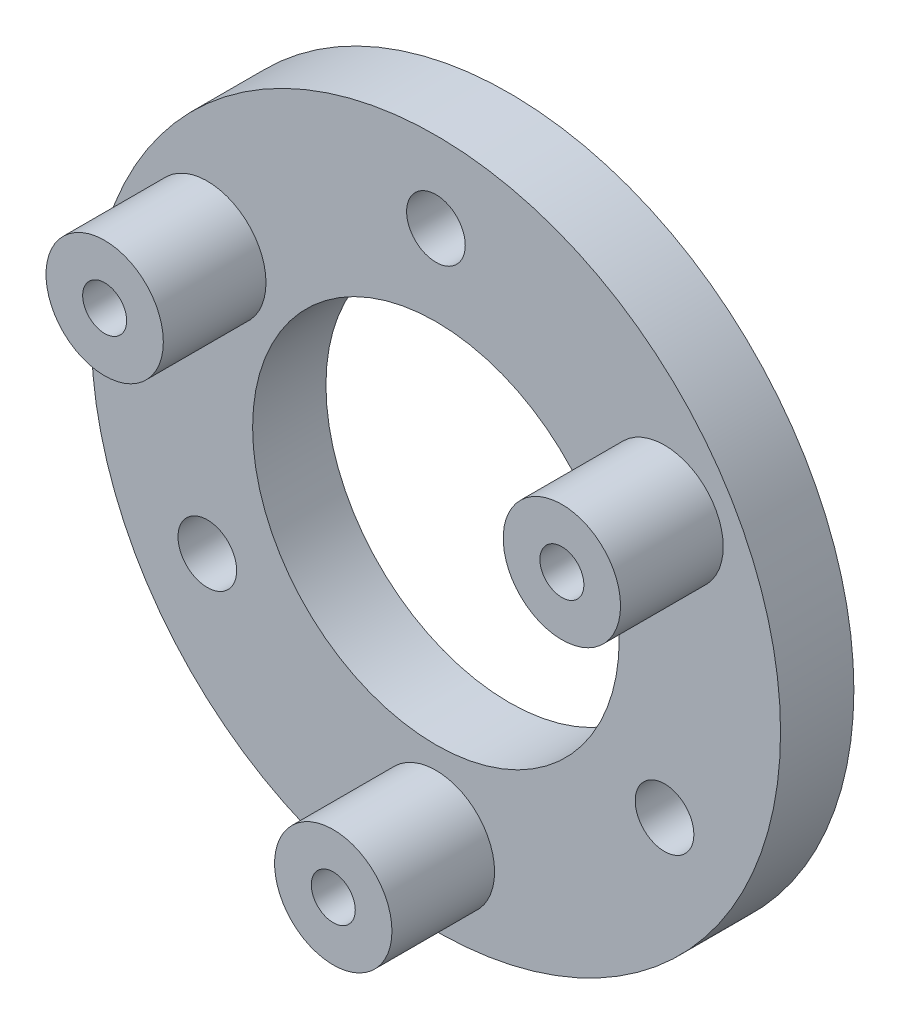
ISO-10303-21;
HEADER;
FILE_DESCRIPTION(('STEP AP214'),'2;1');
FILE_NAME('part.step','',(''),(''),'','','');
FILE_SCHEMA(('AUTOMOTIVE_DESIGN { 1 0 10303 214 1 1 1 1 }'));
ENDSEC;
DATA;
#1=APPLICATION_CONTEXT('core data for automotive mechanical design processes');
#2=APPLICATION_PROTOCOL_DEFINITION('international standard','automotive_design',2000,#1);
#3=PRODUCT_CONTEXT('',#1,'mechanical');
#4=PRODUCT('Part','Part','',(#3));
#5=PRODUCT_RELATED_PRODUCT_CATEGORY('part','',(#4));
#6=PRODUCT_DEFINITION_FORMATION('','',#4);
#7=PRODUCT_DEFINITION_CONTEXT('part definition',#1,'design');
#8=PRODUCT_DEFINITION('design','',#6,#7);
#9=PRODUCT_DEFINITION_SHAPE('','',#8);
#10=(LENGTH_UNIT() NAMED_UNIT(*) SI_UNIT(.MILLI.,.METRE.));
#11=(NAMED_UNIT(*) PLANE_ANGLE_UNIT() SI_UNIT($,.RADIAN.));
#12=(NAMED_UNIT(*) SI_UNIT($,.STERADIAN.) SOLID_ANGLE_UNIT());
#13=UNCERTAINTY_MEASURE_WITH_UNIT(LENGTH_MEASURE(1.E-05),#10,'distance_accuracy_value','');
#14=(GEOMETRIC_REPRESENTATION_CONTEXT(3) GLOBAL_UNCERTAINTY_ASSIGNED_CONTEXT((#13)) GLOBAL_UNIT_ASSIGNED_CONTEXT((#10,
#11,#12)) REPRESENTATION_CONTEXT('',''));
#15=CARTESIAN_POINT('',(0.,0.,0.));
#16=DIRECTION('',(0.,0.,1.));
#17=DIRECTION('',(1.,0.,0.));
#18=AXIS2_PLACEMENT_3D('',#15,#16,#17);
#19=CARTESIAN_POINT('',(0.,0.,5.));
#20=DIRECTION('',(0.,0.,1.));
#21=DIRECTION('',(1.,0.,0.));
#22=AXIS2_PLACEMENT_3D('',#19,#20,#21);
#23=PLANE('',#22);
#24=CARTESIAN_POINT('',(15.5884572681199,8.99999999999997,5.));
#25=DIRECTION('',(0.,0.,1.));
#26=DIRECTION('',(1.,0.,0.));
#27=AXIS2_PLACEMENT_3D('',#24,#25,#26);
#28=CIRCLE('',#27,4.);
#29=CARTESIAN_POINT('',(19.5884572681199,8.99999999999997,5.));
#30=VERTEX_POINT('',#29);
#31=EDGE_CURVE('E153',#30,#30,#28,.T.);
#32=ORIENTED_EDGE('',*,*,#31,.F.);
#33=EDGE_LOOP('',(#32));
#34=FACE_BOUND('',#33,.T.);
#35=CARTESIAN_POINT('',(0.,0.,5.));
#36=DIRECTION('',(0.,0.,1.));
#37=DIRECTION('',(1.,0.,0.));
#38=AXIS2_PLACEMENT_3D('',#35,#36,#37);
#39=CIRCLE('',#38,12.5);
#40=CARTESIAN_POINT('',(12.5,0.,5.));
#41=VERTEX_POINT('',#40);
#42=EDGE_CURVE('E55',#41,#41,#39,.T.);
#43=ORIENTED_EDGE('',*,*,#42,.F.);
#44=EDGE_LOOP('',(#43));
#45=FACE_BOUND('',#44,.T.);
#46=CARTESIAN_POINT('',(0.,0.,5.));
#47=DIRECTION('',(0.,0.,1.));
#48=DIRECTION('',(1.,0.,0.));
#49=AXIS2_PLACEMENT_3D('',#46,#47,#48);
#50=CIRCLE('',#49,23.5);
#51=CARTESIAN_POINT('',(23.5,0.,5.));
#52=VERTEX_POINT('',#51);
#53=EDGE_CURVE('E10',#52,#52,#50,.T.);
#54=ORIENTED_EDGE('',*,*,#53,.T.);
#55=EDGE_LOOP('',(#54));
#56=FACE_BOUND('',#55,.T.);
#57=CARTESIAN_POINT('',(-15.5884572681199,-9.00000000000001,5.));
#58=DIRECTION('',(0.,0.,1.));
#59=DIRECTION('',(1.,0.,0.));
#60=AXIS2_PLACEMENT_3D('',#57,#58,#59);
#61=CIRCLE('',#60,2.);
#62=CARTESIAN_POINT('',(-13.5884572681199,-9.00000000000001,5.));
#63=VERTEX_POINT('',#62);
#64=EDGE_CURVE('E73',#63,#63,#61,.T.);
#65=ORIENTED_EDGE('',*,*,#64,.F.);
#66=EDGE_LOOP('',(#65));
#67=FACE_BOUND('',#66,.T.);
#68=CARTESIAN_POINT('',(15.5884572681199,-9.,5.));
#69=DIRECTION('',(0.,0.,1.));
#70=DIRECTION('',(1.,0.,0.));
#71=AXIS2_PLACEMENT_3D('',#68,#69,#70);
#72=CIRCLE('',#71,2.);
#73=CARTESIAN_POINT('',(17.5884572681199,-9.,5.));
#74=VERTEX_POINT('',#73);
#75=EDGE_CURVE('E88',#74,#74,#72,.T.);
#76=ORIENTED_EDGE('',*,*,#75,.F.);
#77=EDGE_LOOP('',(#76));
#78=FACE_BOUND('',#77,.T.);
#79=CARTESIAN_POINT('',(0.,18.,5.));
#80=DIRECTION('',(0.,0.,1.));
#81=DIRECTION('',(1.,0.,0.));
#82=AXIS2_PLACEMENT_3D('',#79,#80,#81);
#83=CIRCLE('',#82,2.);
#84=CARTESIAN_POINT('',(2.,18.,5.));
#85=VERTEX_POINT('',#84);
#86=EDGE_CURVE('E103',#85,#85,#83,.T.);
#87=ORIENTED_EDGE('',*,*,#86,.F.);
#88=EDGE_LOOP('',(#87));
#89=FACE_BOUND('',#88,.T.);
#90=CARTESIAN_POINT('',(-15.5884572681199,8.99999999999996,5.));
#91=DIRECTION('',(0.,0.,1.));
#92=DIRECTION('',(1.,0.,0.));
#93=AXIS2_PLACEMENT_3D('',#90,#91,#92);
#94=CIRCLE('',#93,4.);
#95=CARTESIAN_POINT('',(-11.5884572681199,8.99999999999996,5.));
#96=VERTEX_POINT('',#95);
#97=EDGE_CURVE('E114',#96,#96,#94,.T.);
#98=ORIENTED_EDGE('',*,*,#97,.F.);
#99=EDGE_LOOP('',(#98));
#100=FACE_BOUND('',#99,.T.);
#101=CARTESIAN_POINT('',(-1.16958309356874E-13,-18.0000000000001,5.));
#102=DIRECTION('',(0.,0.,1.));
#103=DIRECTION('',(1.,0.,0.));
#104=AXIS2_PLACEMENT_3D('',#101,#102,#103);
#105=CIRCLE('',#104,4.);
#106=CARTESIAN_POINT('',(3.99999999999988,-18.0000000000001,5.));
#107=VERTEX_POINT('',#106);
#108=EDGE_CURVE('E136',#107,#107,#105,.T.);
#109=ORIENTED_EDGE('',*,*,#108,.F.);
#110=EDGE_LOOP('',(#109));
#111=FACE_BOUND('',#110,.T.);
#112=ADVANCED_FACE('F38',(#34,#45,#56,#67,#78,#89,#100,#111),#23,.T.);
#113=CARTESIAN_POINT('',(0.,0.,0.));
#114=DIRECTION('',(0.,0.,1.));
#115=DIRECTION('',(1.,0.,0.));
#116=AXIS2_PLACEMENT_3D('',#113,#114,#115);
#117=PLANE('',#116);
#118=CARTESIAN_POINT('',(-15.5884572681199,8.99999999999996,0.));
#119=DIRECTION('',(0.,0.,1.));
#120=DIRECTION('',(1.,0.,0.));
#121=AXIS2_PLACEMENT_3D('',#118,#119,#120);
#122=CIRCLE('',#121,1.5);
#123=CARTESIAN_POINT('',(-14.0884572681199,8.99999999999996,0.));
#124=VERTEX_POINT('',#123);
#125=EDGE_CURVE('E42',#124,#124,#122,.F.);
#126=ORIENTED_EDGE('',*,*,#125,.F.);
#127=EDGE_LOOP('',(#126));
#128=FACE_BOUND('',#127,.T.);
#129=CARTESIAN_POINT('',(15.5884572681199,9.00000000000005,0.));
#130=DIRECTION('',(0.,0.,1.));
#131=DIRECTION('',(1.,0.,0.));
#132=AXIS2_PLACEMENT_3D('',#129,#130,#131);
#133=CIRCLE('',#132,1.5);
#134=CARTESIAN_POINT('',(17.0884572681199,9.00000000000005,0.));
#135=VERTEX_POINT('',#134);
#136=EDGE_CURVE('E64',#135,#135,#133,.F.);
#137=ORIENTED_EDGE('',*,*,#136,.F.);
#138=EDGE_LOOP('',(#137));
#139=FACE_BOUND('',#138,.T.);
#140=CARTESIAN_POINT('',(0.,-18.,0.));
#141=DIRECTION('',(0.,0.,1.));
#142=DIRECTION('',(1.,0.,0.));
#143=AXIS2_PLACEMENT_3D('',#140,#141,#142);
#144=CIRCLE('',#143,1.5);
#145=CARTESIAN_POINT('',(1.50000000000006,-18.,0.));
#146=VERTEX_POINT('',#145);
#147=EDGE_CURVE('E61',#146,#146,#144,.F.);
#148=ORIENTED_EDGE('',*,*,#147,.F.);
#149=EDGE_LOOP('',(#148));
#150=FACE_BOUND('',#149,.T.);
#151=CARTESIAN_POINT('',(0.,0.,0.));
#152=DIRECTION('',(0.,0.,1.));
#153=DIRECTION('',(1.,0.,0.));
#154=AXIS2_PLACEMENT_3D('',#151,#152,#153);
#155=CIRCLE('',#154,23.5);
#156=CARTESIAN_POINT('',(23.5,0.,0.));
#157=VERTEX_POINT('',#156);
#158=EDGE_CURVE('E47',#157,#157,#155,.T.);
#159=ORIENTED_EDGE('',*,*,#158,.F.);
#160=EDGE_LOOP('',(#159));
#161=FACE_BOUND('',#160,.T.);
#162=CARTESIAN_POINT('',(0.,0.,0.));
#163=DIRECTION('',(0.,0.,1.));
#164=DIRECTION('',(1.,0.,0.));
#165=AXIS2_PLACEMENT_3D('',#162,#163,#164);
#166=CIRCLE('',#165,12.5);
#167=CARTESIAN_POINT('',(12.5,0.,0.));
#168=VERTEX_POINT('',#167);
#169=EDGE_CURVE('E58',#168,#168,#166,.T.);
#170=ORIENTED_EDGE('',*,*,#169,.T.);
#171=EDGE_LOOP('',(#170));
#172=FACE_BOUND('',#171,.T.);
#173=ADVANCED_FACE('F126',(#128,#139,#150,#161,#172),#117,.F.);
#174=CARTESIAN_POINT('',(0.,0.,5.));
#175=DIRECTION('',(0.,0.,-1.));
#176=DIRECTION('',(-1.,0.,0.));
#177=AXIS2_PLACEMENT_3D('',#174,#175,#176);
#178=CYLINDRICAL_SURFACE('',#177,23.5);
#179=ORIENTED_EDGE('',*,*,#53,.F.);
#180=EDGE_LOOP('',(#179));
#181=FACE_BOUND('',#180,.T.);
#182=ORIENTED_EDGE('',*,*,#158,.T.);
#183=EDGE_LOOP('',(#182));
#184=FACE_BOUND('',#183,.T.);
#185=ADVANCED_FACE('F40',(#181,#184),#178,.T.);
#186=CARTESIAN_POINT('',(0.,0.,5.));
#187=DIRECTION('',(0.,0.,-1.));
#188=DIRECTION('',(-1.,0.,0.));
#189=AXIS2_PLACEMENT_3D('',#186,#187,#188);
#190=CYLINDRICAL_SURFACE('',#189,12.5);
#191=ORIENTED_EDGE('',*,*,#42,.T.);
#192=EDGE_LOOP('',(#191));
#193=FACE_BOUND('',#192,.T.);
#194=ORIENTED_EDGE('',*,*,#169,.F.);
#195=EDGE_LOOP('',(#194));
#196=FACE_BOUND('',#195,.T.);
#197=ADVANCED_FACE('F221',(#193,#196),#190,.F.);
#198=CARTESIAN_POINT('',(-15.5884572681199,-9.00000000000001,2.));
#199=DIRECTION('',(0.,0.,1.));
#200=DIRECTION('',(1.,0.,0.));
#201=AXIS2_PLACEMENT_3D('',#198,#199,#200);
#202=CYLINDRICAL_SURFACE('',#201,2.);
#203=CARTESIAN_POINT('',(-15.5884572681199,-9.00000000000001,2.));
#204=DIRECTION('',(0.,0.,1.));
#205=DIRECTION('',(1.,0.,0.));
#206=AXIS2_PLACEMENT_3D('',#203,#204,#205);
#207=CIRCLE('',#206,2.);
#208=CARTESIAN_POINT('',(-13.5884572681199,-9.00000000000001,2.));
#209=VERTEX_POINT('',#208);
#210=EDGE_CURVE('E80',#209,#209,#207,.T.);
#211=ORIENTED_EDGE('',*,*,#210,.F.);
#212=EDGE_LOOP('',(#211));
#213=FACE_BOUND('',#212,.T.);
#214=ORIENTED_EDGE('',*,*,#64,.T.);
#215=EDGE_LOOP('',(#214));
#216=FACE_BOUND('',#215,.T.);
#217=ADVANCED_FACE('F217',(#213,#216),#202,.F.);
#218=CARTESIAN_POINT('',(-15.5884572681199,-9.00000000000001,2.));
#219=DIRECTION('',(0.,0.,1.));
#220=DIRECTION('',(1.,0.,0.));
#221=AXIS2_PLACEMENT_3D('',#218,#219,#220);
#222=PLANE('',#221);
#223=ORIENTED_EDGE('',*,*,#210,.T.);
#224=EDGE_LOOP('',(#223));
#225=FACE_BOUND('',#224,.T.);
#226=ADVANCED_FACE('F213',(#225),#222,.T.);
#227=CARTESIAN_POINT('',(15.5884572681199,-9.,2.));
#228=DIRECTION('',(0.,0.,1.));
#229=DIRECTION('',(1.,0.,0.));
#230=AXIS2_PLACEMENT_3D('',#227,#228,#229);
#231=CYLINDRICAL_SURFACE('',#230,2.);
#232=CARTESIAN_POINT('',(15.5884572681199,-9.,2.));
#233=DIRECTION('',(0.,0.,1.));
#234=DIRECTION('',(1.,0.,0.));
#235=AXIS2_PLACEMENT_3D('',#232,#233,#234);
#236=CIRCLE('',#235,2.);
#237=CARTESIAN_POINT('',(17.5884572681199,-9.,2.));
#238=VERTEX_POINT('',#237);
#239=EDGE_CURVE('E111',#238,#238,#236,.T.);
#240=ORIENTED_EDGE('',*,*,#239,.F.);
#241=EDGE_LOOP('',(#240));
#242=FACE_BOUND('',#241,.T.);
#243=ORIENTED_EDGE('',*,*,#75,.T.);
#244=EDGE_LOOP('',(#243));
#245=FACE_BOUND('',#244,.T.);
#246=ADVANCED_FACE('F122',(#242,#245),#231,.F.);
#247=CARTESIAN_POINT('',(15.5884572681199,-9.,2.));
#248=DIRECTION('',(0.,0.,1.));
#249=DIRECTION('',(1.,0.,0.));
#250=AXIS2_PLACEMENT_3D('',#247,#248,#249);
#251=PLANE('',#250);
#252=ORIENTED_EDGE('',*,*,#239,.T.);
#253=EDGE_LOOP('',(#252));
#254=FACE_BOUND('',#253,.T.);
#255=ADVANCED_FACE('F206',(#254),#251,.T.);
#256=CARTESIAN_POINT('',(0.,18.,2.));
#257=DIRECTION('',(0.,0.,1.));
#258=DIRECTION('',(1.,0.,0.));
#259=AXIS2_PLACEMENT_3D('',#256,#257,#258);
#260=CYLINDRICAL_SURFACE('',#259,2.);
#261=CARTESIAN_POINT('',(0.,18.,2.));
#262=DIRECTION('',(0.,0.,1.));
#263=DIRECTION('',(1.,0.,0.));
#264=AXIS2_PLACEMENT_3D('',#261,#262,#263);
#265=CIRCLE('',#264,2.);
#266=CARTESIAN_POINT('',(2.,18.,2.));
#267=VERTEX_POINT('',#266);
#268=EDGE_CURVE('E97',#267,#267,#265,.T.);
#269=ORIENTED_EDGE('',*,*,#268,.F.);
#270=EDGE_LOOP('',(#269));
#271=FACE_BOUND('',#270,.T.);
#272=ORIENTED_EDGE('',*,*,#86,.T.);
#273=EDGE_LOOP('',(#272));
#274=FACE_BOUND('',#273,.T.);
#275=ADVANCED_FACE('F203',(#271,#274),#260,.F.);
#276=CARTESIAN_POINT('',(0.,18.,2.));
#277=DIRECTION('',(0.,0.,1.));
#278=DIRECTION('',(1.,0.,0.));
#279=AXIS2_PLACEMENT_3D('',#276,#277,#278);
#280=PLANE('',#279);
#281=ORIENTED_EDGE('',*,*,#268,.T.);
#282=EDGE_LOOP('',(#281));
#283=FACE_BOUND('',#282,.T.);
#284=ADVANCED_FACE('F199',(#283),#280,.T.);
#285=CARTESIAN_POINT('',(0.,-18.,95.));
#286=DIRECTION('',(0.,0.,-1.));
#287=DIRECTION('',(-1.,0.,0.));
#288=AXIS2_PLACEMENT_3D('',#285,#286,#287);
#289=CYLINDRICAL_SURFACE('',#288,1.5);
#290=CARTESIAN_POINT('',(0.,-18.,12.));
#291=DIRECTION('',(0.,0.,1.));
#292=DIRECTION('',(1.,0.,0.));
#293=AXIS2_PLACEMENT_3D('',#290,#291,#292);
#294=CIRCLE('',#293,1.5);
#295=CARTESIAN_POINT('',(1.50000000000006,-18.,12.));
#296=VERTEX_POINT('',#295);
#297=EDGE_CURVE('E140',#296,#296,#294,.T.);
#298=ORIENTED_EDGE('',*,*,#297,.T.);
#299=EDGE_LOOP('',(#298));
#300=FACE_BOUND('',#299,.T.);
#301=ORIENTED_EDGE('',*,*,#147,.T.);
#302=EDGE_LOOP('',(#301));
#303=FACE_BOUND('',#302,.T.);
#304=ADVANCED_FACE('F195',(#300,#303),#289,.F.);
#305=CARTESIAN_POINT('',(15.5884572681199,9.00000000000005,95.));
#306=DIRECTION('',(0.,0.,-1.));
#307=DIRECTION('',(-1.,0.,0.));
#308=AXIS2_PLACEMENT_3D('',#305,#306,#307);
#309=CYLINDRICAL_SURFACE('',#308,1.5);
#310=CARTESIAN_POINT('',(15.5884572681199,9.00000000000005,12.));
#311=DIRECTION('',(0.,0.,1.));
#312=DIRECTION('',(1.,0.,0.));
#313=AXIS2_PLACEMENT_3D('',#310,#311,#312);
#314=CIRCLE('',#313,1.5);
#315=CARTESIAN_POINT('',(17.0884572681199,9.00000000000005,12.));
#316=VERTEX_POINT('',#315);
#317=EDGE_CURVE('E145',#316,#316,#314,.T.);
#318=ORIENTED_EDGE('',*,*,#317,.T.);
#319=EDGE_LOOP('',(#318));
#320=FACE_BOUND('',#319,.T.);
#321=ORIENTED_EDGE('',*,*,#136,.T.);
#322=EDGE_LOOP('',(#321));
#323=FACE_BOUND('',#322,.T.);
#324=ADVANCED_FACE('F191',(#320,#323),#309,.F.);
#325=CARTESIAN_POINT('',(-15.5884572681199,8.99999999999996,95.));
#326=DIRECTION('',(0.,0.,-1.));
#327=DIRECTION('',(-1.,0.,0.));
#328=AXIS2_PLACEMENT_3D('',#325,#326,#327);
#329=CYLINDRICAL_SURFACE('',#328,1.5);
#330=CARTESIAN_POINT('',(-15.5884572681199,8.99999999999996,12.));
#331=DIRECTION('',(0.,0.,1.));
#332=DIRECTION('',(1.,0.,0.));
#333=AXIS2_PLACEMENT_3D('',#330,#331,#332);
#334=CIRCLE('',#333,1.5);
#335=CARTESIAN_POINT('',(-14.0884572681199,8.99999999999996,12.));
#336=VERTEX_POINT('',#335);
#337=EDGE_CURVE('E158',#336,#336,#334,.T.);
#338=ORIENTED_EDGE('',*,*,#337,.T.);
#339=EDGE_LOOP('',(#338));
#340=FACE_BOUND('',#339,.T.);
#341=ORIENTED_EDGE('',*,*,#125,.T.);
#342=EDGE_LOOP('',(#341));
#343=FACE_BOUND('',#342,.T.);
#344=ADVANCED_FACE('F185',(#340,#343),#329,.F.);
#345=CARTESIAN_POINT('',(-15.5884572681199,8.99999999999996,12.));
#346=DIRECTION('',(0.,0.,1.));
#347=DIRECTION('',(1.,0.,0.));
#348=AXIS2_PLACEMENT_3D('',#345,#346,#347);
#349=PLANE('',#348);
#350=CARTESIAN_POINT('',(-15.5884572681199,8.99999999999996,12.));
#351=DIRECTION('',(0.,0.,1.));
#352=DIRECTION('',(1.,0.,0.));
#353=AXIS2_PLACEMENT_3D('',#350,#351,#352);
#354=CIRCLE('',#353,4.);
#355=CARTESIAN_POINT('',(-11.5884572681199,8.99999999999996,12.));
#356=VERTEX_POINT('',#355);
#357=EDGE_CURVE('E65',#356,#356,#354,.T.);
#358=ORIENTED_EDGE('',*,*,#357,.T.);
#359=EDGE_LOOP('',(#358));
#360=FACE_BOUND('',#359,.T.);
#361=ORIENTED_EDGE('',*,*,#337,.F.);
#362=EDGE_LOOP('',(#361));
#363=FACE_BOUND('',#362,.T.);
#364=ADVANCED_FACE('F175',(#360,#363),#349,.T.);
#365=CARTESIAN_POINT('',(-15.5884572681199,8.99999999999996,12.));
#366=DIRECTION('',(0.,0.,-1.));
#367=DIRECTION('',(-1.,0.,0.));
#368=AXIS2_PLACEMENT_3D('',#365,#366,#367);
#369=CYLINDRICAL_SURFACE('',#368,4.);
#370=ORIENTED_EDGE('',*,*,#357,.F.);
#371=EDGE_LOOP('',(#370));
#372=FACE_BOUND('',#371,.T.);
#373=ORIENTED_EDGE('',*,*,#97,.T.);
#374=EDGE_LOOP('',(#373));
#375=FACE_BOUND('',#374,.T.);
#376=ADVANCED_FACE('F172',(#372,#375),#369,.T.);
#377=CARTESIAN_POINT('',(15.5884572681199,8.99999999999997,12.));
#378=DIRECTION('',(0.,0.,1.));
#379=DIRECTION('',(1.,0.,0.));
#380=AXIS2_PLACEMENT_3D('',#377,#378,#379);
#381=PLANE('',#380);
#382=CARTESIAN_POINT('',(15.5884572681199,8.99999999999997,12.));
#383=DIRECTION('',(0.,0.,1.));
#384=DIRECTION('',(1.,0.,0.));
#385=AXIS2_PLACEMENT_3D('',#382,#383,#384);
#386=CIRCLE('',#385,4.);
#387=CARTESIAN_POINT('',(19.5884572681199,8.99999999999997,12.));
#388=VERTEX_POINT('',#387);
#389=EDGE_CURVE('E154',#388,#388,#386,.T.);
#390=ORIENTED_EDGE('',*,*,#389,.T.);
#391=EDGE_LOOP('',(#390));
#392=FACE_BOUND('',#391,.T.);
#393=ORIENTED_EDGE('',*,*,#317,.F.);
#394=EDGE_LOOP('',(#393));
#395=FACE_BOUND('',#394,.T.);
#396=ADVANCED_FACE('F174',(#392,#395),#381,.T.);
#397=CARTESIAN_POINT('',(15.5884572681199,8.99999999999997,12.));
#398=DIRECTION('',(0.,0.,-1.));
#399=DIRECTION('',(-1.,0.,0.));
#400=AXIS2_PLACEMENT_3D('',#397,#398,#399);
#401=CYLINDRICAL_SURFACE('',#400,4.);
#402=ORIENTED_EDGE('',*,*,#389,.F.);
#403=EDGE_LOOP('',(#402));
#404=FACE_BOUND('',#403,.T.);
#405=ORIENTED_EDGE('',*,*,#31,.T.);
#406=EDGE_LOOP('',(#405));
#407=FACE_BOUND('',#406,.T.);
#408=ADVANCED_FACE('F182',(#404,#407),#401,.T.);
#409=CARTESIAN_POINT('',(-1.16958309356874E-13,-18.0000000000001,12.));
#410=DIRECTION('',(0.,0.,1.));
#411=DIRECTION('',(1.,0.,0.));
#412=AXIS2_PLACEMENT_3D('',#409,#410,#411);
#413=PLANE('',#412);
#414=CARTESIAN_POINT('',(-1.16958309356874E-13,-18.0000000000001,12.));
#415=DIRECTION('',(0.,0.,1.));
#416=DIRECTION('',(1.,0.,0.));
#417=AXIS2_PLACEMENT_3D('',#414,#415,#416);
#418=CIRCLE('',#417,4.);
#419=CARTESIAN_POINT('',(3.99999999999988,-18.0000000000001,12.));
#420=VERTEX_POINT('',#419);
#421=EDGE_CURVE('E139',#420,#420,#418,.T.);
#422=ORIENTED_EDGE('',*,*,#421,.T.);
#423=EDGE_LOOP('',(#422));
#424=FACE_BOUND('',#423,.T.);
#425=ORIENTED_EDGE('',*,*,#297,.F.);
#426=EDGE_LOOP('',(#425));
#427=FACE_BOUND('',#426,.T.);
#428=ADVANCED_FACE('F302',(#424,#427),#413,.T.);
#429=CARTESIAN_POINT('',(-1.16958309356874E-13,-18.0000000000001,12.));
#430=DIRECTION('',(0.,0.,-1.));
#431=DIRECTION('',(-1.,0.,0.));
#432=AXIS2_PLACEMENT_3D('',#429,#430,#431);
#433=CYLINDRICAL_SURFACE('',#432,4.);
#434=ORIENTED_EDGE('',*,*,#421,.F.);
#435=EDGE_LOOP('',(#434));
#436=FACE_BOUND('',#435,.T.);
#437=ORIENTED_EDGE('',*,*,#108,.T.);
#438=EDGE_LOOP('',(#437));
#439=FACE_BOUND('',#438,.T.);
#440=ADVANCED_FACE('F306',(#436,#439),#433,.T.);
#441=CLOSED_SHELL('',(#112,#173,#185,#197,#217,#226,#246,#255,#275,#284,#304,#324,#344,#364,
#376,#396,#408,#428,#440));
#442=MANIFOLD_SOLID_BREP('B2',#441);
#443=ADVANCED_BREP_SHAPE_REPRESENTATION('',(#18,#442),#14);
#444=SHAPE_DEFINITION_REPRESENTATION(#9,#443);
ENDSEC;
END-ISO-10303-21;
